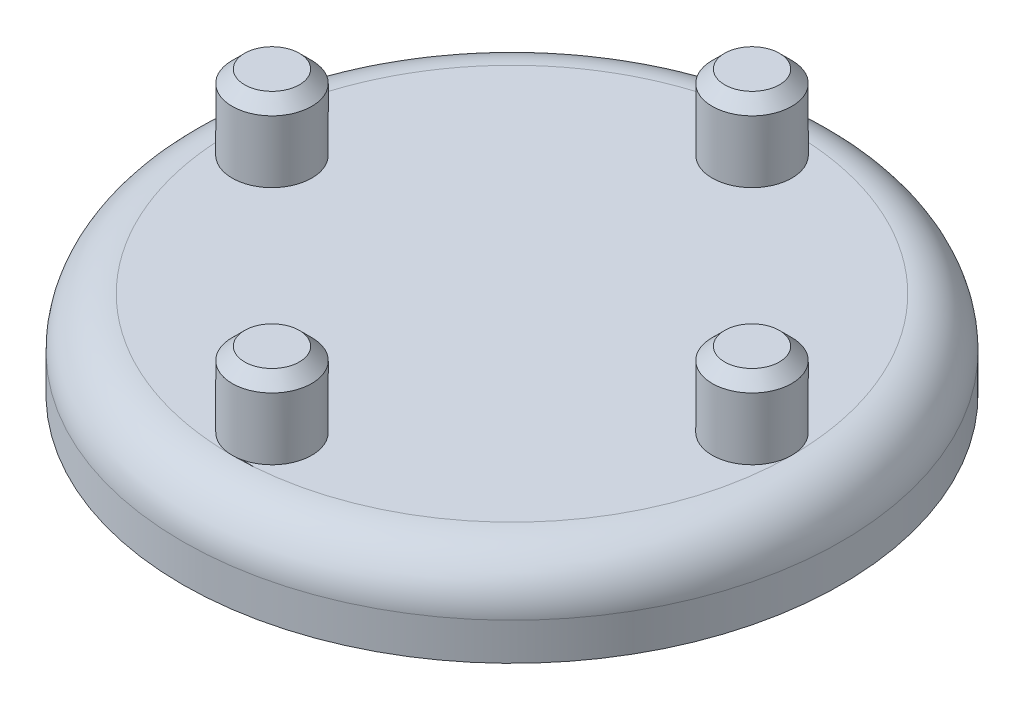
ISO-10303-21;
HEADER;
FILE_DESCRIPTION(('STEP AP214'),'2;1');
FILE_NAME('part.step','',(''),(''),'','','');
FILE_SCHEMA(('AUTOMOTIVE_DESIGN { 1 0 10303 214 1 1 1 1 }'));
ENDSEC;
DATA;
#1=APPLICATION_CONTEXT('core data for automotive mechanical design processes');
#2=APPLICATION_PROTOCOL_DEFINITION('international standard','automotive_design',2000,#1);
#3=PRODUCT_CONTEXT('',#1,'mechanical');
#4=PRODUCT('Part','Part','',(#3));
#5=PRODUCT_RELATED_PRODUCT_CATEGORY('part','',(#4));
#6=PRODUCT_DEFINITION_FORMATION('','',#4);
#7=PRODUCT_DEFINITION_CONTEXT('part definition',#1,'design');
#8=PRODUCT_DEFINITION('design','',#6,#7);
#9=PRODUCT_DEFINITION_SHAPE('','',#8);
#10=(LENGTH_UNIT() NAMED_UNIT(*) SI_UNIT(.MILLI.,.METRE.));
#11=(NAMED_UNIT(*) PLANE_ANGLE_UNIT() SI_UNIT($,.RADIAN.));
#12=(NAMED_UNIT(*) SI_UNIT($,.STERADIAN.) SOLID_ANGLE_UNIT());
#13=UNCERTAINTY_MEASURE_WITH_UNIT(LENGTH_MEASURE(1.E-05),#10,'distance_accuracy_value','');
#14=(GEOMETRIC_REPRESENTATION_CONTEXT(3) GLOBAL_UNCERTAINTY_ASSIGNED_CONTEXT((#13)) GLOBAL_UNIT_ASSIGNED_CONTEXT((#10,
#11,#12)) REPRESENTATION_CONTEXT('',''));
#15=CARTESIAN_POINT('',(0.,0.,0.));
#16=DIRECTION('',(0.,0.,1.));
#17=DIRECTION('',(1.,0.,0.));
#18=AXIS2_PLACEMENT_3D('',#15,#16,#17);
#19=CARTESIAN_POINT('',(0.,7.,0.));
#20=DIRECTION('',(0.,-1.,0.));
#21=DIRECTION('',(0.,0.,-1.));
#22=AXIS2_PLACEMENT_3D('',#19,#20,#21);
#23=CYLINDRICAL_SURFACE('',#22,26.5);
#24=CARTESIAN_POINT('',(0.,3.,0.));
#25=DIRECTION('',(0.,1.,0.));
#26=DIRECTION('',(0.,0.,1.));
#27=AXIS2_PLACEMENT_3D('',#24,#25,#26);
#28=CIRCLE('',#27,26.5);
#29=CARTESIAN_POINT('',(0.,3.,26.5));
#30=VERTEX_POINT('',#29);
#31=EDGE_CURVE('E105',#30,#30,#28,.F.);
#32=ORIENTED_EDGE('',*,*,#31,.T.);
#33=EDGE_LOOP('',(#32));
#34=FACE_BOUND('',#33,.T.);
#35=CARTESIAN_POINT('',(0.,0.,0.));
#36=DIRECTION('',(0.,1.,0.));
#37=DIRECTION('',(0.,0.,1.));
#38=AXIS2_PLACEMENT_3D('',#35,#36,#37);
#39=CIRCLE('',#38,26.5);
#40=CARTESIAN_POINT('',(0.,0.,26.5));
#41=VERTEX_POINT('',#40);
#42=EDGE_CURVE('E96',#41,#41,#39,.T.);
#43=ORIENTED_EDGE('',*,*,#42,.T.);
#44=EDGE_LOOP('',(#43));
#45=FACE_BOUND('',#44,.T.);
#46=ADVANCED_FACE('F41',(#34,#45),#23,.T.);
#47=CARTESIAN_POINT('',(0.,7.,0.));
#48=DIRECTION('',(0.,1.,0.));
#49=DIRECTION('',(0.,0.,1.));
#50=AXIS2_PLACEMENT_3D('',#47,#48,#49);
#51=PLANE('',#50);
#52=CARTESIAN_POINT('',(0.,7.,0.));
#53=DIRECTION('',(0.,1.,0.));
#54=DIRECTION('',(0.,0.,1.));
#55=AXIS2_PLACEMENT_3D('',#52,#53,#54);
#56=CIRCLE('',#55,22.5);
#57=CARTESIAN_POINT('',(-22.5,7.,0.));
#58=VERTEX_POINT('',#57);
#59=CARTESIAN_POINT('',(0.,7.,22.5));
#60=VERTEX_POINT('',#59);
#61=EDGE_CURVE('E81',#58,#60,#56,.T.);
#62=ORIENTED_EDGE('',*,*,#61,.T.);
#63=CARTESIAN_POINT('',(0.,7.,19.3));
#64=DIRECTION('',(0.,1.,0.));
#65=DIRECTION('',(0.,0.,1.));
#66=AXIS2_PLACEMENT_3D('',#63,#64,#65);
#67=CIRCLE('',#66,3.2);
#68=EDGE_CURVE('E56',#60,#60,#67,.T.);
#69=ORIENTED_EDGE('',*,*,#68,.F.);
#70=CARTESIAN_POINT('',(22.5,7.,0.));
#71=VERTEX_POINT('',#70);
#72=EDGE_CURVE('E85',#60,#71,#56,.T.);
#73=ORIENTED_EDGE('',*,*,#72,.T.);
#74=CARTESIAN_POINT('',(19.3,7.,0.));
#75=DIRECTION('',(0.,1.,0.));
#76=DIRECTION('',(0.,0.,1.));
#77=AXIS2_PLACEMENT_3D('',#74,#75,#76);
#78=CIRCLE('',#77,3.2);
#79=EDGE_CURVE('E91',#71,#71,#78,.T.);
#80=ORIENTED_EDGE('',*,*,#79,.F.);
#81=CARTESIAN_POINT('',(0.,7.,0.));
#82=DIRECTION('',(0.,1.,0.));
#83=DIRECTION('',(0.,0.,1.));
#84=AXIS2_PLACEMENT_3D('',#81,#82,#83);
#85=CIRCLE('',#84,22.5);
#86=CARTESIAN_POINT('',(0.,7.,-22.5));
#87=VERTEX_POINT('',#86);
#88=EDGE_CURVE('E80',#71,#87,#85,.T.);
#89=ORIENTED_EDGE('',*,*,#88,.T.);
#90=CARTESIAN_POINT('',(0.,7.,-19.3));
#91=DIRECTION('',(0.,1.,0.));
#92=DIRECTION('',(0.,0.,1.));
#93=AXIS2_PLACEMENT_3D('',#90,#91,#92);
#94=CIRCLE('',#93,3.2);
#95=EDGE_CURVE('E61',#87,#87,#94,.T.);
#96=ORIENTED_EDGE('',*,*,#95,.F.);
#97=EDGE_CURVE('E70',#87,#58,#85,.T.);
#98=ORIENTED_EDGE('',*,*,#97,.T.);
#99=CARTESIAN_POINT('',(-19.3,7.,0.));
#100=DIRECTION('',(0.,1.,0.));
#101=DIRECTION('',(0.,0.,1.));
#102=AXIS2_PLACEMENT_3D('',#99,#100,#101);
#103=CIRCLE('',#102,3.2);
#104=EDGE_CURVE('E75',#58,#58,#103,.T.);
#105=ORIENTED_EDGE('',*,*,#104,.F.);
#106=EDGE_LOOP('',(#62,#69,#73,#80,#89,#96,#98,#105));
#107=FACE_BOUND('',#106,.T.);
#108=ADVANCED_FACE('F73',(#107),#51,.T.);
#109=CARTESIAN_POINT('',(0.,0.,0.));
#110=DIRECTION('',(0.,1.,0.));
#111=DIRECTION('',(0.,0.,1.));
#112=AXIS2_PLACEMENT_3D('',#109,#110,#111);
#113=PLANE('',#112);
#114=ORIENTED_EDGE('',*,*,#42,.F.);
#115=EDGE_LOOP('',(#114));
#116=FACE_BOUND('',#115,.T.);
#117=ADVANCED_FACE('F152',(#116),#113,.F.);
#118=CARTESIAN_POINT('',(19.3,13.,0.));
#119=DIRECTION('',(0.,-1.,0.));
#120=DIRECTION('',(0.,0.,-1.));
#121=AXIS2_PLACEMENT_3D('',#118,#119,#120);
#122=CYLINDRICAL_SURFACE('',#121,3.2);
#123=CARTESIAN_POINT('',(19.3,12.,0.));
#124=DIRECTION('',(0.,1.,0.));
#125=DIRECTION('',(0.,0.,1.));
#126=AXIS2_PLACEMENT_3D('',#123,#124,#125);
#127=CIRCLE('',#126,3.2);
#128=CARTESIAN_POINT('',(19.3,12.,3.20000000000001));
#129=VERTEX_POINT('',#128);
#130=EDGE_CURVE('E121',#129,#129,#127,.F.);
#131=ORIENTED_EDGE('',*,*,#130,.T.);
#132=EDGE_LOOP('',(#131));
#133=FACE_BOUND('',#132,.T.);
#134=ORIENTED_EDGE('',*,*,#79,.T.);
#135=EDGE_LOOP('',(#134));
#136=FACE_BOUND('',#135,.T.);
#137=ADVANCED_FACE('F192',(#133,#136),#122,.T.);
#138=CARTESIAN_POINT('',(19.3,13.,0.));
#139=DIRECTION('',(0.,1.,0.));
#140=DIRECTION('',(0.,0.,1.));
#141=AXIS2_PLACEMENT_3D('',#138,#139,#140);
#142=PLANE('',#141);
#143=CARTESIAN_POINT('',(19.3,13.,0.));
#144=DIRECTION('',(0.,1.,0.));
#145=DIRECTION('',(0.,0.,1.));
#146=AXIS2_PLACEMENT_3D('',#143,#144,#145);
#147=CIRCLE('',#146,2.19999999999999);
#148=CARTESIAN_POINT('',(19.3,13.,2.2));
#149=VERTEX_POINT('',#148);
#150=EDGE_CURVE('E117',#149,#149,#147,.T.);
#151=ORIENTED_EDGE('',*,*,#150,.T.);
#152=EDGE_LOOP('',(#151));
#153=FACE_BOUND('',#152,.T.);
#154=ADVANCED_FACE('F190',(#153),#142,.T.);
#155=CARTESIAN_POINT('',(-19.3,13.,0.));
#156=DIRECTION('',(0.,-1.,0.));
#157=DIRECTION('',(0.,0.,-1.));
#158=AXIS2_PLACEMENT_3D('',#155,#156,#157);
#159=CYLINDRICAL_SURFACE('',#158,3.2);
#160=CARTESIAN_POINT('',(-19.3,12.,0.));
#161=DIRECTION('',(0.,1.,0.));
#162=DIRECTION('',(0.,0.,1.));
#163=AXIS2_PLACEMENT_3D('',#160,#161,#162);
#164=CIRCLE('',#163,3.2);
#165=CARTESIAN_POINT('',(-19.3,12.,3.2));
#166=VERTEX_POINT('',#165);
#167=EDGE_CURVE('E113',#166,#166,#164,.F.);
#168=ORIENTED_EDGE('',*,*,#167,.T.);
#169=EDGE_LOOP('',(#168));
#170=FACE_BOUND('',#169,.T.);
#171=ORIENTED_EDGE('',*,*,#104,.T.);
#172=EDGE_LOOP('',(#171));
#173=FACE_BOUND('',#172,.T.);
#174=ADVANCED_FACE('F89',(#170,#173),#159,.T.);
#175=CARTESIAN_POINT('',(-19.3,13.,0.));
#176=DIRECTION('',(0.,1.,0.));
#177=DIRECTION('',(0.,0.,1.));
#178=AXIS2_PLACEMENT_3D('',#175,#176,#177);
#179=PLANE('',#178);
#180=CARTESIAN_POINT('',(-19.3,13.,0.));
#181=DIRECTION('',(0.,1.,0.));
#182=DIRECTION('',(0.,0.,1.));
#183=AXIS2_PLACEMENT_3D('',#180,#181,#182);
#184=CIRCLE('',#183,2.19999999999999);
#185=CARTESIAN_POINT('',(-19.3,13.,2.19999999999999));
#186=VERTEX_POINT('',#185);
#187=EDGE_CURVE('E109',#186,#186,#184,.T.);
#188=ORIENTED_EDGE('',*,*,#187,.T.);
#189=EDGE_LOOP('',(#188));
#190=FACE_BOUND('',#189,.T.);
#191=ADVANCED_FACE('F160',(#190),#179,.T.);
#192=CARTESIAN_POINT('',(0.,3.,0.));
#193=DIRECTION('',(0.,1.,0.));
#194=DIRECTION('',(0.,0.,1.));
#195=AXIS2_PLACEMENT_3D('',#192,#193,#194);
#196=TOROIDAL_SURFACE('',#195,22.5,4.);
#197=ORIENTED_EDGE('',*,*,#31,.F.);
#198=EDGE_LOOP('',(#197));
#199=FACE_BOUND('',#198,.T.);
#200=ORIENTED_EDGE('',*,*,#61,.F.);
#201=ORIENTED_EDGE('',*,*,#97,.F.);
#202=ORIENTED_EDGE('',*,*,#88,.F.);
#203=ORIENTED_EDGE('',*,*,#72,.F.);
#204=EDGE_LOOP('',(#200,#201,#202,#203));
#205=FACE_BOUND('',#204,.T.);
#206=ADVANCED_FACE('F84',(#199,#205),#196,.T.);
#207=CARTESIAN_POINT('',(-19.3,13.,0.));
#208=DIRECTION('',(0.,-1.,0.));
#209=DIRECTION('',(0.,0.,-1.));
#210=AXIS2_PLACEMENT_3D('',#207,#208,#209);
#211=CONICAL_SURFACE('',#210,2.19999999999999,0.785398163397446);
#212=ORIENTED_EDGE('',*,*,#167,.F.);
#213=EDGE_LOOP('',(#212));
#214=FACE_BOUND('',#213,.T.);
#215=ORIENTED_EDGE('',*,*,#187,.F.);
#216=EDGE_LOOP('',(#215));
#217=FACE_BOUND('',#216,.T.);
#218=ADVANCED_FACE('F159',(#214,#217),#211,.T.);
#219=CARTESIAN_POINT('',(19.3,13.,0.));
#220=DIRECTION('',(0.,-1.,0.));
#221=DIRECTION('',(0.,0.,-1.));
#222=AXIS2_PLACEMENT_3D('',#219,#220,#221);
#223=CONICAL_SURFACE('',#222,2.19999999999999,0.785398163397446);
#224=ORIENTED_EDGE('',*,*,#130,.F.);
#225=EDGE_LOOP('',(#224));
#226=FACE_BOUND('',#225,.T.);
#227=ORIENTED_EDGE('',*,*,#150,.F.);
#228=EDGE_LOOP('',(#227));
#229=FACE_BOUND('',#228,.T.);
#230=ADVANCED_FACE('F168',(#226,#229),#223,.T.);
#231=CARTESIAN_POINT('',(0.,13.,-19.3));
#232=DIRECTION('',(0.,-1.,0.));
#233=DIRECTION('',(0.,0.,-1.));
#234=AXIS2_PLACEMENT_3D('',#231,#232,#233);
#235=CYLINDRICAL_SURFACE('',#234,3.2);
#236=CARTESIAN_POINT('',(0.,12.,-19.3));
#237=DIRECTION('',(0.,1.,0.));
#238=DIRECTION('',(0.,0.,1.));
#239=AXIS2_PLACEMENT_3D('',#236,#237,#238);
#240=CIRCLE('',#239,3.2);
#241=CARTESIAN_POINT('',(0.,12.,-16.1));
#242=VERTEX_POINT('',#241);
#243=EDGE_CURVE('E129',#242,#242,#240,.F.);
#244=ORIENTED_EDGE('',*,*,#243,.T.);
#245=EDGE_LOOP('',(#244));
#246=FACE_BOUND('',#245,.T.);
#247=ORIENTED_EDGE('',*,*,#95,.T.);
#248=EDGE_LOOP('',(#247));
#249=FACE_BOUND('',#248,.T.);
#250=ADVANCED_FACE('F174',(#246,#249),#235,.T.);
#251=CARTESIAN_POINT('',(0.,13.,-19.3));
#252=DIRECTION('',(0.,1.,0.));
#253=DIRECTION('',(0.,0.,1.));
#254=AXIS2_PLACEMENT_3D('',#251,#252,#253);
#255=PLANE('',#254);
#256=CARTESIAN_POINT('',(0.,13.,-19.3));
#257=DIRECTION('',(0.,1.,0.));
#258=DIRECTION('',(0.,0.,1.));
#259=AXIS2_PLACEMENT_3D('',#256,#257,#258);
#260=CIRCLE('',#259,2.19999999999999);
#261=CARTESIAN_POINT('',(0.,13.,-17.1));
#262=VERTEX_POINT('',#261);
#263=EDGE_CURVE('E125',#262,#262,#260,.T.);
#264=ORIENTED_EDGE('',*,*,#263,.T.);
#265=EDGE_LOOP('',(#264));
#266=FACE_BOUND('',#265,.T.);
#267=ADVANCED_FACE('F183',(#266),#255,.T.);
#268=CARTESIAN_POINT('',(0.,13.,19.3));
#269=DIRECTION('',(0.,-1.,0.));
#270=DIRECTION('',(0.,0.,-1.));
#271=AXIS2_PLACEMENT_3D('',#268,#269,#270);
#272=CYLINDRICAL_SURFACE('',#271,3.2);
#273=CARTESIAN_POINT('',(0.,12.,19.3));
#274=DIRECTION('',(0.,1.,0.));
#275=DIRECTION('',(0.,0.,1.));
#276=AXIS2_PLACEMENT_3D('',#273,#274,#275);
#277=CIRCLE('',#276,3.2);
#278=CARTESIAN_POINT('',(0.,12.,22.5));
#279=VERTEX_POINT('',#278);
#280=EDGE_CURVE('E11',#279,#279,#277,.F.);
#281=ORIENTED_EDGE('',*,*,#280,.T.);
#282=EDGE_LOOP('',(#281));
#283=FACE_BOUND('',#282,.T.);
#284=ORIENTED_EDGE('',*,*,#68,.T.);
#285=EDGE_LOOP('',(#284));
#286=FACE_BOUND('',#285,.T.);
#287=ADVANCED_FACE('F208',(#283,#286),#272,.T.);
#288=CARTESIAN_POINT('',(0.,13.,19.3));
#289=DIRECTION('',(0.,1.,0.));
#290=DIRECTION('',(0.,0.,1.));
#291=AXIS2_PLACEMENT_3D('',#288,#289,#290);
#292=PLANE('',#291);
#293=CARTESIAN_POINT('',(0.,13.,19.3));
#294=DIRECTION('',(0.,1.,0.));
#295=DIRECTION('',(0.,0.,1.));
#296=AXIS2_PLACEMENT_3D('',#293,#294,#295);
#297=CIRCLE('',#296,2.19999999999999);
#298=CARTESIAN_POINT('',(0.,13.,21.5));
#299=VERTEX_POINT('',#298);
#300=EDGE_CURVE('E51',#299,#299,#297,.T.);
#301=ORIENTED_EDGE('',*,*,#300,.T.);
#302=EDGE_LOOP('',(#301));
#303=FACE_BOUND('',#302,.T.);
#304=ADVANCED_FACE('F136',(#303),#292,.T.);
#305=CARTESIAN_POINT('',(0.,13.,-19.3));
#306=DIRECTION('',(0.,-1.,0.));
#307=DIRECTION('',(0.,0.,-1.));
#308=AXIS2_PLACEMENT_3D('',#305,#306,#307);
#309=CONICAL_SURFACE('',#308,2.19999999999999,0.785398163397446);
#310=ORIENTED_EDGE('',*,*,#243,.F.);
#311=EDGE_LOOP('',(#310));
#312=FACE_BOUND('',#311,.T.);
#313=ORIENTED_EDGE('',*,*,#263,.F.);
#314=EDGE_LOOP('',(#313));
#315=FACE_BOUND('',#314,.T.);
#316=ADVANCED_FACE('F139',(#312,#315),#309,.T.);
#317=CARTESIAN_POINT('',(0.,13.,19.3));
#318=DIRECTION('',(0.,-1.,0.));
#319=DIRECTION('',(0.,0.,-1.));
#320=AXIS2_PLACEMENT_3D('',#317,#318,#319);
#321=CONICAL_SURFACE('',#320,2.19999999999999,0.785398163397446);
#322=ORIENTED_EDGE('',*,*,#280,.F.);
#323=EDGE_LOOP('',(#322));
#324=FACE_BOUND('',#323,.T.);
#325=ORIENTED_EDGE('',*,*,#300,.F.);
#326=EDGE_LOOP('',(#325));
#327=FACE_BOUND('',#326,.T.);
#328=ADVANCED_FACE('F44',(#324,#327),#321,.T.);
#329=CLOSED_SHELL('',(#46,#108,#117,#137,#154,#174,#191,#206,#218,#230,#250,#267,#287,#304,#316,#328));
#330=MANIFOLD_SOLID_BREP('B2',#329);
#331=ADVANCED_BREP_SHAPE_REPRESENTATION('',(#18,#330),#14);
#332=SHAPE_DEFINITION_REPRESENTATION(#9,#331);
ENDSEC;
END-ISO-10303-21;
